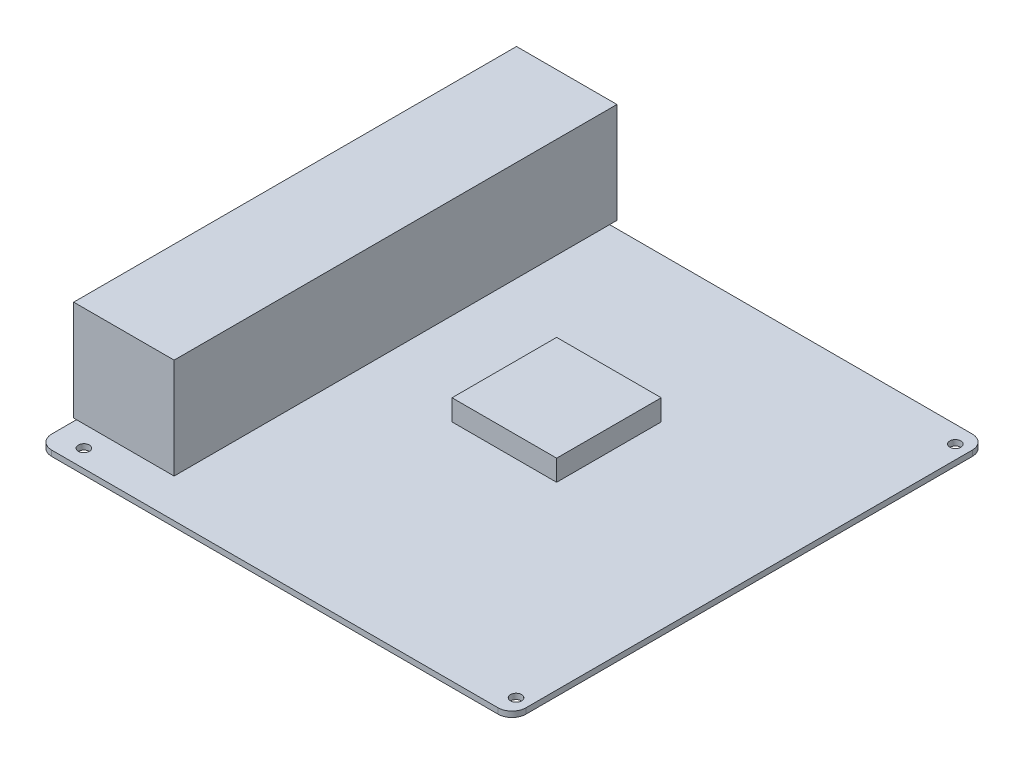
ISO-10303-21;
HEADER;
FILE_DESCRIPTION(('STEP AP214'),'2;1');
FILE_NAME('part.step','',(''),(''),'','','');
FILE_SCHEMA(('AUTOMOTIVE_DESIGN { 1 0 10303 214 1 1 1 1 }'));
ENDSEC;
DATA;
#1=APPLICATION_CONTEXT('core data for automotive mechanical design processes');
#2=APPLICATION_PROTOCOL_DEFINITION('international standard','automotive_design',2000,#1);
#3=PRODUCT_CONTEXT('',#1,'mechanical');
#4=PRODUCT('Part','Part','',(#3));
#5=PRODUCT_RELATED_PRODUCT_CATEGORY('part','',(#4));
#6=PRODUCT_DEFINITION_FORMATION('','',#4);
#7=PRODUCT_DEFINITION_CONTEXT('part definition',#1,'design');
#8=PRODUCT_DEFINITION('design','',#6,#7);
#9=PRODUCT_DEFINITION_SHAPE('','',#8);
#10=(LENGTH_UNIT() NAMED_UNIT(*) SI_UNIT(.MILLI.,.METRE.));
#11=(NAMED_UNIT(*) PLANE_ANGLE_UNIT() SI_UNIT($,.RADIAN.));
#12=(NAMED_UNIT(*) SI_UNIT($,.STERADIAN.) SOLID_ANGLE_UNIT());
#13=UNCERTAINTY_MEASURE_WITH_UNIT(LENGTH_MEASURE(1.E-05),#10,'distance_accuracy_value','');
#14=(GEOMETRIC_REPRESENTATION_CONTEXT(3) GLOBAL_UNCERTAINTY_ASSIGNED_CONTEXT((#13)) GLOBAL_UNIT_ASSIGNED_CONTEXT((#10,
#11,#12)) REPRESENTATION_CONTEXT('',''));
#15=CARTESIAN_POINT('',(0.,0.,0.));
#16=DIRECTION('',(0.,0.,1.));
#17=DIRECTION('',(1.,0.,0.));
#18=AXIS2_PLACEMENT_3D('',#15,#16,#17);
#19=CARTESIAN_POINT('',(20.5,9.5,-33.));
#20=DIRECTION('',(-1.,0.,0.));
#21=DIRECTION('',(0.,0.,1.));
#22=AXIS2_PLACEMENT_3D('',#19,#20,#21);
#23=PLANE('',#22);
#24=DIRECTION('',(0.,0.,-1.));
#25=VECTOR('',#24,1.);
#26=CARTESIAN_POINT('',(20.5,2.,-33.));
#27=LINE('',#26,#25);
#28=CARTESIAN_POINT('',(20.5,2.,4.49999999999998));
#29=VERTEX_POINT('',#28);
#30=CARTESIAN_POINT('',(20.5,2.,-33.));
#31=VERTEX_POINT('',#30);
#32=EDGE_CURVE('E158',#29,#31,#27,.T.);
#33=ORIENTED_EDGE('',*,*,#32,.T.);
#34=DIRECTION('',(0.,-1.,0.));
#35=VECTOR('',#34,1.);
#36=CARTESIAN_POINT('',(20.5,9.5,-33.));
#37=LINE('',#36,#35);
#38=CARTESIAN_POINT('',(20.5,9.5,-33.));
#39=VERTEX_POINT('',#38);
#40=EDGE_CURVE('E14',#39,#31,#37,.T.);
#41=ORIENTED_EDGE('',*,*,#40,.F.);
#42=DIRECTION('',(0.,0.,-1.));
#43=VECTOR('',#42,1.);
#44=CARTESIAN_POINT('',(20.5,9.5,-33.));
#45=LINE('',#44,#43);
#46=CARTESIAN_POINT('',(20.5,9.5,4.49999999999998));
#47=VERTEX_POINT('',#46);
#48=EDGE_CURVE('E146',#47,#39,#45,.T.);
#49=ORIENTED_EDGE('',*,*,#48,.F.);
#50=DIRECTION('',(0.,-1.,0.));
#51=VECTOR('',#50,1.);
#52=CARTESIAN_POINT('',(20.5,9.5,4.49999999999998));
#53=LINE('',#52,#51);
#54=EDGE_CURVE('E154',#47,#29,#53,.T.);
#55=ORIENTED_EDGE('',*,*,#54,.T.);
#56=EDGE_LOOP('',(#33,#41,#49,#55));
#57=FACE_BOUND('',#56,.T.);
#58=ADVANCED_FACE('F95',(#57),#23,.F.);
#59=CARTESIAN_POINT('',(-17.,9.5,-33.));
#60=DIRECTION('',(0.,0.,1.));
#61=DIRECTION('',(1.,0.,0.));
#62=AXIS2_PLACEMENT_3D('',#59,#60,#61);
#63=PLANE('',#62);
#64=DIRECTION('',(-1.,0.,0.));
#65=VECTOR('',#64,1.);
#66=CARTESIAN_POINT('',(-17.,2.,-33.));
#67=LINE('',#66,#65);
#68=CARTESIAN_POINT('',(-17.,2.,-33.));
#69=VERTEX_POINT('',#68);
#70=EDGE_CURVE('E150',#31,#69,#67,.T.);
#71=ORIENTED_EDGE('',*,*,#70,.T.);
#72=DIRECTION('',(0.,-1.,0.));
#73=VECTOR('',#72,1.);
#74=CARTESIAN_POINT('',(-17.,9.5,-33.));
#75=LINE('',#74,#73);
#76=CARTESIAN_POINT('',(-17.,9.5,-33.));
#77=VERTEX_POINT('',#76);
#78=EDGE_CURVE('E103',#77,#69,#75,.T.);
#79=ORIENTED_EDGE('',*,*,#78,.F.);
#80=DIRECTION('',(-1.,0.,0.));
#81=VECTOR('',#80,1.);
#82=CARTESIAN_POINT('',(-17.,9.5,-33.));
#83=LINE('',#82,#81);
#84=EDGE_CURVE('E141',#39,#77,#83,.T.);
#85=ORIENTED_EDGE('',*,*,#84,.F.);
#86=ORIENTED_EDGE('',*,*,#40,.T.);
#87=EDGE_LOOP('',(#71,#79,#85,#86));
#88=FACE_BOUND('',#87,.T.);
#89=ADVANCED_FACE('F149',(#88),#63,.F.);
#90=CARTESIAN_POINT('',(-17.,9.5,-33.));
#91=DIRECTION('',(1.,0.,0.));
#92=DIRECTION('',(0.,0.,-1.));
#93=AXIS2_PLACEMENT_3D('',#90,#91,#92);
#94=PLANE('',#93);
#95=DIRECTION('',(0.,0.,1.));
#96=VECTOR('',#95,1.);
#97=CARTESIAN_POINT('',(-17.,2.,-33.));
#98=LINE('',#97,#96);
#99=CARTESIAN_POINT('',(-17.,2.,4.49999999999998));
#100=VERTEX_POINT('',#99);
#101=EDGE_CURVE('E128',#69,#100,#98,.T.);
#102=ORIENTED_EDGE('',*,*,#101,.T.);
#103=DIRECTION('',(0.,-1.,0.));
#104=VECTOR('',#103,1.);
#105=CARTESIAN_POINT('',(-17.,9.5,4.49999999999998));
#106=LINE('',#105,#104);
#107=CARTESIAN_POINT('',(-17.,9.5,4.49999999999998));
#108=VERTEX_POINT('',#107);
#109=EDGE_CURVE('E151',#108,#100,#106,.T.);
#110=ORIENTED_EDGE('',*,*,#109,.F.);
#111=DIRECTION('',(0.,0.,1.));
#112=VECTOR('',#111,1.);
#113=CARTESIAN_POINT('',(-17.,9.5,-33.));
#114=LINE('',#113,#112);
#115=EDGE_CURVE('E144',#77,#108,#114,.T.);
#116=ORIENTED_EDGE('',*,*,#115,.F.);
#117=ORIENTED_EDGE('',*,*,#78,.T.);
#118=EDGE_LOOP('',(#102,#110,#116,#117));
#119=FACE_BOUND('',#118,.T.);
#120=ADVANCED_FACE('F152',(#119),#94,.F.);
#121=CARTESIAN_POINT('',(-17.,9.5,4.49999999999998));
#122=DIRECTION('',(0.,0.,-1.));
#123=DIRECTION('',(-1.,0.,0.));
#124=AXIS2_PLACEMENT_3D('',#121,#122,#123);
#125=PLANE('',#124);
#126=DIRECTION('',(1.,0.,0.));
#127=VECTOR('',#126,1.);
#128=CARTESIAN_POINT('',(-17.,2.,4.49999999999998));
#129=LINE('',#128,#127);
#130=EDGE_CURVE('E134',#100,#29,#129,.T.);
#131=ORIENTED_EDGE('',*,*,#130,.T.);
#132=ORIENTED_EDGE('',*,*,#54,.F.);
#133=DIRECTION('',(1.,0.,0.));
#134=VECTOR('',#133,1.);
#135=CARTESIAN_POINT('',(-17.,9.5,4.49999999999998));
#136=LINE('',#135,#134);
#137=EDGE_CURVE('E111',#108,#47,#136,.T.);
#138=ORIENTED_EDGE('',*,*,#137,.F.);
#139=ORIENTED_EDGE('',*,*,#109,.T.);
#140=EDGE_LOOP('',(#131,#132,#138,#139));
#141=FACE_BOUND('',#140,.T.);
#142=ADVANCED_FACE('F165',(#141),#125,.F.);
#143=CARTESIAN_POINT('',(0.,9.5,0.));
#144=DIRECTION('',(0.,1.,0.));
#145=DIRECTION('',(0.,0.,1.));
#146=AXIS2_PLACEMENT_3D('',#143,#144,#145);
#147=PLANE('',#146);
#148=ORIENTED_EDGE('',*,*,#48,.T.);
#149=ORIENTED_EDGE('',*,*,#84,.T.);
#150=ORIENTED_EDGE('',*,*,#115,.T.);
#151=ORIENTED_EDGE('',*,*,#137,.T.);
#152=EDGE_LOOP('',(#148,#149,#150,#151));
#153=FACE_BOUND('',#152,.T.);
#154=ADVANCED_FACE('F142',(#153),#147,.T.);
#155=CARTESIAN_POINT('',(0.,2.,0.));
#156=DIRECTION('',(0.,1.,0.));
#157=DIRECTION('',(0.,0.,1.));
#158=AXIS2_PLACEMENT_3D('',#155,#156,#157);
#159=PLANE('',#158);
#160=ORIENTED_EDGE('',*,*,#32,.F.);
#161=ORIENTED_EDGE('',*,*,#130,.F.);
#162=ORIENTED_EDGE('',*,*,#101,.F.);
#163=ORIENTED_EDGE('',*,*,#70,.F.);
#164=EDGE_LOOP('',(#160,#161,#162,#163));
#165=FACE_BOUND('',#164,.T.);
#166=ADVANCED_FACE('F168',(#165),#159,.F.);
#167=CLOSED_SHELL('',(#58,#89,#120,#142,#154,#166));
#168=MANIFOLD_SOLID_BREP('B2',#167);
#169=CARTESIAN_POINT('',(-86.,2.,-87.62));
#170=DIRECTION('',(0.,0.,-1.));
#171=DIRECTION('',(-1.,0.,0.));
#172=AXIS2_PLACEMENT_3D('',#169,#170,#171);
#173=PLANE('',#172);
#174=DIRECTION('',(-1.,0.,0.));
#175=VECTOR('',#174,1.);
#176=CARTESIAN_POINT('',(-68.,38.,-87.62));
#177=LINE('',#176,#175);
#178=CARTESIAN_POINT('',(-50.,38.,-87.62));
#179=VERTEX_POINT('',#178);
#180=CARTESIAN_POINT('',(-86.,38.,-87.62));
#181=VERTEX_POINT('',#180);
#182=EDGE_CURVE('E287',#179,#181,#177,.T.);
#183=ORIENTED_EDGE('',*,*,#182,.F.);
#184=DIRECTION('',(0.,1.,0.));
#185=VECTOR('',#184,1.);
#186=CARTESIAN_POINT('',(-50.,2.,-87.62));
#187=LINE('',#186,#185);
#188=CARTESIAN_POINT('',(-50.,2.,-87.62));
#189=VERTEX_POINT('',#188);
#190=EDGE_CURVE('E322',#189,#179,#187,.T.);
#191=ORIENTED_EDGE('',*,*,#190,.F.);
#192=DIRECTION('',(-1.,0.,0.));
#193=VECTOR('',#192,1.);
#194=CARTESIAN_POINT('',(-68.,2.,-87.62));
#195=LINE('',#194,#193);
#196=CARTESIAN_POINT('',(-86.,2.,-87.62));
#197=VERTEX_POINT('',#196);
#198=EDGE_CURVE('E233',#189,#197,#195,.T.);
#199=ORIENTED_EDGE('',*,*,#198,.T.);
#200=DIRECTION('',(0.,1.,0.));
#201=VECTOR('',#200,1.);
#202=CARTESIAN_POINT('',(-86.,2.,-87.62));
#203=LINE('',#202,#201);
#204=EDGE_CURVE('E320',#197,#181,#203,.T.);
#205=ORIENTED_EDGE('',*,*,#204,.T.);
#206=EDGE_LOOP('',(#183,#191,#199,#205));
#207=FACE_BOUND('',#206,.T.);
#208=ADVANCED_FACE('F229',(#207),#173,.T.);
#209=CARTESIAN_POINT('',(-50.,2.,-87.62));
#210=DIRECTION('',(1.,0.,0.));
#211=DIRECTION('',(0.,0.,-1.));
#212=AXIS2_PLACEMENT_3D('',#209,#210,#211);
#213=PLANE('',#212);
#214=DIRECTION('',(0.,0.,-1.));
#215=VECTOR('',#214,1.);
#216=CARTESIAN_POINT('',(-50.,38.,-8.24500000000004));
#217=LINE('',#216,#215);
#218=CARTESIAN_POINT('',(-50.,38.,71.13));
#219=VERTEX_POINT('',#218);
#220=EDGE_CURVE('E295',#219,#179,#217,.T.);
#221=ORIENTED_EDGE('',*,*,#220,.F.);
#222=DIRECTION('',(0.,1.,0.));
#223=VECTOR('',#222,1.);
#224=CARTESIAN_POINT('',(-50.,2.,71.13));
#225=LINE('',#224,#223);
#226=CARTESIAN_POINT('',(-50.,2.,71.13));
#227=VERTEX_POINT('',#226);
#228=EDGE_CURVE('E273',#227,#219,#225,.T.);
#229=ORIENTED_EDGE('',*,*,#228,.F.);
#230=DIRECTION('',(0.,0.,-1.));
#231=VECTOR('',#230,1.);
#232=CARTESIAN_POINT('',(-50.,2.,-8.24500000000004));
#233=LINE('',#232,#231);
#234=EDGE_CURVE('E300',#227,#189,#233,.T.);
#235=ORIENTED_EDGE('',*,*,#234,.T.);
#236=ORIENTED_EDGE('',*,*,#190,.T.);
#237=EDGE_LOOP('',(#221,#229,#235,#236));
#238=FACE_BOUND('',#237,.T.);
#239=ADVANCED_FACE('F324',(#238),#213,.T.);
#240=CARTESIAN_POINT('',(-86.,2.,71.13));
#241=DIRECTION('',(0.,0.,1.));
#242=DIRECTION('',(1.,0.,0.));
#243=AXIS2_PLACEMENT_3D('',#240,#241,#242);
#244=PLANE('',#243);
#245=DIRECTION('',(1.,0.,0.));
#246=VECTOR('',#245,1.);
#247=CARTESIAN_POINT('',(-68.,38.,71.1299999999999));
#248=LINE('',#247,#246);
#249=CARTESIAN_POINT('',(-86.,38.,71.13));
#250=VERTEX_POINT('',#249);
#251=EDGE_CURVE('E267',#250,#219,#248,.T.);
#252=ORIENTED_EDGE('',*,*,#251,.F.);
#253=DIRECTION('',(0.,1.,0.));
#254=VECTOR('',#253,1.);
#255=CARTESIAN_POINT('',(-86.,2.,71.13));
#256=LINE('',#255,#254);
#257=CARTESIAN_POINT('',(-86.,2.,71.13));
#258=VERTEX_POINT('',#257);
#259=EDGE_CURVE('E271',#258,#250,#256,.T.);
#260=ORIENTED_EDGE('',*,*,#259,.F.);
#261=DIRECTION('',(1.,0.,0.));
#262=VECTOR('',#261,1.);
#263=CARTESIAN_POINT('',(-68.,2.,71.1299999999999));
#264=LINE('',#263,#262);
#265=EDGE_CURVE('E240',#258,#227,#264,.T.);
#266=ORIENTED_EDGE('',*,*,#265,.T.);
#267=ORIENTED_EDGE('',*,*,#228,.T.);
#268=EDGE_LOOP('',(#252,#260,#266,#267));
#269=FACE_BOUND('',#268,.T.);
#270=ADVANCED_FACE('F269',(#269),#244,.T.);
#271=CARTESIAN_POINT('',(-86.,2.,-87.62));
#272=DIRECTION('',(-1.,0.,0.));
#273=DIRECTION('',(0.,0.,1.));
#274=AXIS2_PLACEMENT_3D('',#271,#272,#273);
#275=PLANE('',#274);
#276=DIRECTION('',(0.,0.,1.));
#277=VECTOR('',#276,1.);
#278=CARTESIAN_POINT('',(-86.,38.,-8.24500000000004));
#279=LINE('',#278,#277);
#280=EDGE_CURVE('E278',#181,#250,#279,.T.);
#281=ORIENTED_EDGE('',*,*,#280,.F.);
#282=ORIENTED_EDGE('',*,*,#204,.F.);
#283=DIRECTION('',(0.,0.,1.));
#284=VECTOR('',#283,1.);
#285=CARTESIAN_POINT('',(-86.,2.,-8.24500000000004));
#286=LINE('',#285,#284);
#287=EDGE_CURVE('E93',#197,#258,#286,.T.);
#288=ORIENTED_EDGE('',*,*,#287,.T.);
#289=ORIENTED_EDGE('',*,*,#259,.T.);
#290=EDGE_LOOP('',(#281,#282,#288,#289));
#291=FACE_BOUND('',#290,.T.);
#292=ADVANCED_FACE('F281',(#291),#275,.T.);
#293=CARTESIAN_POINT('',(-50.,38.,71.1299999999999));
#294=DIRECTION('',(0.,1.,0.));
#295=DIRECTION('',(0.,0.,-1.));
#296=AXIS2_PLACEMENT_3D('',#293,#294,#295);
#297=PLANE('',#296);
#298=ORIENTED_EDGE('',*,*,#220,.T.);
#299=ORIENTED_EDGE('',*,*,#182,.T.);
#300=ORIENTED_EDGE('',*,*,#280,.T.);
#301=ORIENTED_EDGE('',*,*,#251,.T.);
#302=EDGE_LOOP('',(#298,#299,#300,#301));
#303=FACE_BOUND('',#302,.T.);
#304=ADVANCED_FACE('F286',(#303),#297,.T.);
#305=CARTESIAN_POINT('',(-86.,2.,-87.62));
#306=DIRECTION('',(0.,1.,0.));
#307=DIRECTION('',(0.,0.,1.));
#308=AXIS2_PLACEMENT_3D('',#305,#306,#307);
#309=PLANE('',#308);
#310=ORIENTED_EDGE('',*,*,#287,.F.);
#311=ORIENTED_EDGE('',*,*,#198,.F.);
#312=ORIENTED_EDGE('',*,*,#234,.F.);
#313=ORIENTED_EDGE('',*,*,#265,.F.);
#314=EDGE_LOOP('',(#310,#311,#312,#313));
#315=FACE_BOUND('',#314,.T.);
#316=ADVANCED_FACE('F231',(#315),#309,.F.);
#317=OPEN_SHELL('',(#208,#239,#270,#292,#304,#316));
#318=SHELL_BASED_SURFACE_MODEL('B8',(#317));
#319=CARTESIAN_POINT('',(85.,2.,85.));
#320=DIRECTION('',(-1.,0.,0.));
#321=DIRECTION('',(0.,0.,1.));
#322=AXIS2_PLACEMENT_3D('',#319,#320,#321);
#323=PLANE('',#322);
#324=DIRECTION('',(0.,0.,-1.));
#325=VECTOR('',#324,1.);
#326=CARTESIAN_POINT('',(85.,2.,85.));
#327=LINE('',#326,#325);
#328=CARTESIAN_POINT('',(85.,2.,80.));
#329=VERTEX_POINT('',#328);
#330=CARTESIAN_POINT('',(85.,2.,-80.));
#331=VERTEX_POINT('',#330);
#332=EDGE_CURVE('E498',#329,#331,#327,.T.);
#333=ORIENTED_EDGE('',*,*,#332,.F.);
#334=DIRECTION('',(0.,-1.,0.));
#335=VECTOR('',#334,1.);
#336=CARTESIAN_POINT('',(85.,2.,80.));
#337=LINE('',#336,#335);
#338=CARTESIAN_POINT('',(85.,0.,80.));
#339=VERTEX_POINT('',#338);
#340=EDGE_CURVE('E524',#329,#339,#337,.T.);
#341=ORIENTED_EDGE('',*,*,#340,.T.);
#342=DIRECTION('',(0.,0.,-1.));
#343=VECTOR('',#342,1.);
#344=CARTESIAN_POINT('',(85.,0.,85.));
#345=LINE('',#344,#343);
#346=CARTESIAN_POINT('',(85.,0.,-80.));
#347=VERTEX_POINT('',#346);
#348=EDGE_CURVE('E530',#339,#347,#345,.T.);
#349=ORIENTED_EDGE('',*,*,#348,.T.);
#350=DIRECTION('',(0.,-1.,0.));
#351=VECTOR('',#350,1.);
#352=CARTESIAN_POINT('',(85.,2.,-80.));
#353=LINE('',#352,#351);
#354=EDGE_CURVE('E522',#347,#331,#353,.F.);
#355=ORIENTED_EDGE('',*,*,#354,.T.);
#356=EDGE_LOOP('',(#333,#341,#349,#355));
#357=FACE_BOUND('',#356,.T.);
#358=ADVANCED_FACE('F406',(#357),#323,.F.);
#359=CARTESIAN_POINT('',(-85.,2.,-85.));
#360=DIRECTION('',(0.,0.,1.));
#361=DIRECTION('',(1.,0.,0.));
#362=AXIS2_PLACEMENT_3D('',#359,#360,#361);
#363=PLANE('',#362);
#364=DIRECTION('',(-1.,0.,0.));
#365=VECTOR('',#364,1.);
#366=CARTESIAN_POINT('',(-85.,2.,-85.));
#367=LINE('',#366,#365);
#368=CARTESIAN_POINT('',(80.,2.,-85.));
#369=VERTEX_POINT('',#368);
#370=CARTESIAN_POINT('',(-80.,2.,-85.));
#371=VERTEX_POINT('',#370);
#372=EDGE_CURVE('E501',#369,#371,#367,.T.);
#373=ORIENTED_EDGE('',*,*,#372,.F.);
#374=DIRECTION('',(0.,-1.,0.));
#375=VECTOR('',#374,1.);
#376=CARTESIAN_POINT('',(80.,2.,-85.));
#377=LINE('',#376,#375);
#378=CARTESIAN_POINT('',(80.,0.,-85.));
#379=VERTEX_POINT('',#378);
#380=EDGE_CURVE('E227',#369,#379,#377,.T.);
#381=ORIENTED_EDGE('',*,*,#380,.T.);
#382=DIRECTION('',(-1.,0.,0.));
#383=VECTOR('',#382,1.);
#384=CARTESIAN_POINT('',(-85.,0.,-85.));
#385=LINE('',#384,#383);
#386=CARTESIAN_POINT('',(-80.,0.,-85.));
#387=VERTEX_POINT('',#386);
#388=EDGE_CURVE('E503',#379,#387,#385,.T.);
#389=ORIENTED_EDGE('',*,*,#388,.T.);
#390=DIRECTION('',(0.,-1.,0.));
#391=VECTOR('',#390,1.);
#392=CARTESIAN_POINT('',(-80.,2.,-85.));
#393=LINE('',#392,#391);
#394=EDGE_CURVE('E414',#387,#371,#393,.F.);
#395=ORIENTED_EDGE('',*,*,#394,.T.);
#396=EDGE_LOOP('',(#373,#381,#389,#395));
#397=FACE_BOUND('',#396,.T.);
#398=ADVANCED_FACE('F584',(#397),#363,.F.);
#399=CARTESIAN_POINT('',(-85.,2.,85.));
#400=DIRECTION('',(1.,0.,0.));
#401=DIRECTION('',(0.,0.,-1.));
#402=AXIS2_PLACEMENT_3D('',#399,#400,#401);
#403=PLANE('',#402);
#404=DIRECTION('',(0.,0.,1.));
#405=VECTOR('',#404,1.);
#406=CARTESIAN_POINT('',(-85.,0.,85.));
#407=LINE('',#406,#405);
#408=CARTESIAN_POINT('',(-85.,0.,-80.));
#409=VERTEX_POINT('',#408);
#410=CARTESIAN_POINT('',(-85.,0.,80.));
#411=VERTEX_POINT('',#410);
#412=EDGE_CURVE('E499',#409,#411,#407,.T.);
#413=ORIENTED_EDGE('',*,*,#412,.T.);
#414=DIRECTION('',(0.,-1.,0.));
#415=VECTOR('',#414,1.);
#416=CARTESIAN_POINT('',(-85.,2.,80.));
#417=LINE('',#416,#415);
#418=CARTESIAN_POINT('',(-85.,2.,80.));
#419=VERTEX_POINT('',#418);
#420=EDGE_CURVE('E477',#411,#419,#417,.F.);
#421=ORIENTED_EDGE('',*,*,#420,.T.);
#422=DIRECTION('',(0.,0.,1.));
#423=VECTOR('',#422,1.);
#424=CARTESIAN_POINT('',(-85.,2.,85.));
#425=LINE('',#424,#423);
#426=CARTESIAN_POINT('',(-85.,2.,-80.));
#427=VERTEX_POINT('',#426);
#428=EDGE_CURVE('E542',#427,#419,#425,.T.);
#429=ORIENTED_EDGE('',*,*,#428,.F.);
#430=DIRECTION('',(0.,-1.,0.));
#431=VECTOR('',#430,1.);
#432=CARTESIAN_POINT('',(-85.,2.,-80.));
#433=LINE('',#432,#431);
#434=EDGE_CURVE('E482',#427,#409,#433,.T.);
#435=ORIENTED_EDGE('',*,*,#434,.T.);
#436=EDGE_LOOP('',(#413,#421,#429,#435));
#437=FACE_BOUND('',#436,.T.);
#438=ADVANCED_FACE('F582',(#437),#403,.F.);
#439=CARTESIAN_POINT('',(-85.,2.,85.));
#440=DIRECTION('',(0.,0.,-1.));
#441=DIRECTION('',(-1.,0.,0.));
#442=AXIS2_PLACEMENT_3D('',#439,#440,#441);
#443=PLANE('',#442);
#444=DIRECTION('',(1.,0.,0.));
#445=VECTOR('',#444,1.);
#446=CARTESIAN_POINT('',(-85.,2.,85.));
#447=LINE('',#446,#445);
#448=CARTESIAN_POINT('',(-80.,2.,85.));
#449=VERTEX_POINT('',#448);
#450=CARTESIAN_POINT('',(80.,2.,85.));
#451=VERTEX_POINT('',#450);
#452=EDGE_CURVE('E492',#449,#451,#447,.T.);
#453=ORIENTED_EDGE('',*,*,#452,.F.);
#454=DIRECTION('',(0.,-1.,0.));
#455=VECTOR('',#454,1.);
#456=CARTESIAN_POINT('',(-80.,2.,85.));
#457=LINE('',#456,#455);
#458=CARTESIAN_POINT('',(-80.,0.,85.));
#459=VERTEX_POINT('',#458);
#460=EDGE_CURVE('E476',#449,#459,#457,.T.);
#461=ORIENTED_EDGE('',*,*,#460,.T.);
#462=DIRECTION('',(1.,0.,0.));
#463=VECTOR('',#462,1.);
#464=CARTESIAN_POINT('',(-85.,0.,85.));
#465=LINE('',#464,#463);
#466=CARTESIAN_POINT('',(80.,0.,85.));
#467=VERTEX_POINT('',#466);
#468=EDGE_CURVE('E489',#459,#467,#465,.T.);
#469=ORIENTED_EDGE('',*,*,#468,.T.);
#470=DIRECTION('',(0.,-1.,0.));
#471=VECTOR('',#470,1.);
#472=CARTESIAN_POINT('',(80.,2.,85.));
#473=LINE('',#472,#471);
#474=EDGE_CURVE('E494',#467,#451,#473,.F.);
#475=ORIENTED_EDGE('',*,*,#474,.T.);
#476=EDGE_LOOP('',(#453,#461,#469,#475));
#477=FACE_BOUND('',#476,.T.);
#478=ADVANCED_FACE('F488',(#477),#443,.F.);
#479=CARTESIAN_POINT('',(0.,2.,0.));
#480=DIRECTION('',(0.,-1.,0.));
#481=DIRECTION('',(0.,0.,-1.));
#482=AXIS2_PLACEMENT_3D('',#479,#480,#481);
#483=PLANE('',#482);
#484=CARTESIAN_POINT('',(-74.84,2.,78.65));
#485=DIRECTION('',(0.,1.,0.));
#486=DIRECTION('',(0.,0.,1.));
#487=AXIS2_PLACEMENT_3D('',#484,#485,#486);
#488=CIRCLE('',#487,1.98);
#489=CARTESIAN_POINT('',(-74.84,2.,80.63));
#490=VERTEX_POINT('',#489);
#491=EDGE_CURVE('E538',#490,#490,#488,.T.);
#492=ORIENTED_EDGE('',*,*,#491,.F.);
#493=EDGE_LOOP('',(#492));
#494=FACE_BOUND('',#493,.T.);
#495=CARTESIAN_POINT('',(-51.98,2.,-78.83));
#496=DIRECTION('',(0.,1.,0.));
#497=DIRECTION('',(0.,0.,1.));
#498=AXIS2_PLACEMENT_3D('',#495,#496,#497);
#499=CIRCLE('',#498,1.98);
#500=CARTESIAN_POINT('',(-51.98,2.,-76.85));
#501=VERTEX_POINT('',#500);
#502=EDGE_CURVE('E558',#501,#501,#499,.T.);
#503=ORIENTED_EDGE('',*,*,#502,.F.);
#504=EDGE_LOOP('',(#503));
#505=FACE_BOUND('',#504,.T.);
#506=CARTESIAN_POINT('',(80.1,2.,-78.83));
#507=DIRECTION('',(0.,1.,0.));
#508=DIRECTION('',(0.,0.,1.));
#509=AXIS2_PLACEMENT_3D('',#506,#507,#508);
#510=CIRCLE('',#509,1.98);
#511=CARTESIAN_POINT('',(80.1,2.,-76.85));
#512=VERTEX_POINT('',#511);
#513=EDGE_CURVE('E552',#512,#512,#510,.T.);
#514=ORIENTED_EDGE('',*,*,#513,.F.);
#515=EDGE_LOOP('',(#514));
#516=FACE_BOUND('',#515,.T.);
#517=CARTESIAN_POINT('',(80.1,2.,78.65));
#518=DIRECTION('',(0.,1.,0.));
#519=DIRECTION('',(0.,0.,1.));
#520=AXIS2_PLACEMENT_3D('',#517,#518,#519);
#521=CIRCLE('',#520,1.98);
#522=CARTESIAN_POINT('',(80.1,2.,80.63));
#523=VERTEX_POINT('',#522);
#524=EDGE_CURVE('E546',#523,#523,#521,.T.);
#525=ORIENTED_EDGE('',*,*,#524,.F.);
#526=EDGE_LOOP('',(#525));
#527=FACE_BOUND('',#526,.T.);
#528=ORIENTED_EDGE('',*,*,#428,.T.);
#529=CARTESIAN_POINT('',(-80.,2.,80.));
#530=DIRECTION('',(0.,-1.,0.));
#531=DIRECTION('',(0.,0.,-1.));
#532=AXIS2_PLACEMENT_3D('',#529,#530,#531);
#533=CIRCLE('',#532,5.);
#534=EDGE_CURVE('E520',#419,#449,#533,.F.);
#535=ORIENTED_EDGE('',*,*,#534,.T.);
#536=ORIENTED_EDGE('',*,*,#452,.T.);
#537=CARTESIAN_POINT('',(80.,2.,80.));
#538=DIRECTION('',(0.,-1.,0.));
#539=DIRECTION('',(0.,0.,-1.));
#540=AXIS2_PLACEMENT_3D('',#537,#538,#539);
#541=CIRCLE('',#540,5.);
#542=EDGE_CURVE('E518',#451,#329,#541,.F.);
#543=ORIENTED_EDGE('',*,*,#542,.T.);
#544=ORIENTED_EDGE('',*,*,#332,.T.);
#545=CARTESIAN_POINT('',(80.,2.,-80.));
#546=DIRECTION('',(0.,-1.,0.));
#547=DIRECTION('',(0.,0.,-1.));
#548=AXIS2_PLACEMENT_3D('',#545,#546,#547);
#549=CIRCLE('',#548,5.);
#550=EDGE_CURVE('E427',#331,#369,#549,.F.);
#551=ORIENTED_EDGE('',*,*,#550,.T.);
#552=ORIENTED_EDGE('',*,*,#372,.T.);
#553=CARTESIAN_POINT('',(-80.,2.,-80.));
#554=DIRECTION('',(0.,-1.,0.));
#555=DIRECTION('',(0.,0.,-1.));
#556=AXIS2_PLACEMENT_3D('',#553,#554,#555);
#557=CIRCLE('',#556,5.);
#558=EDGE_CURVE('E515',#371,#427,#557,.F.);
#559=ORIENTED_EDGE('',*,*,#558,.T.);
#560=EDGE_LOOP('',(#528,#535,#536,#543,#544,#551,#552,#559));
#561=FACE_BOUND('',#560,.T.);
#562=ADVANCED_FACE('F569',(#494,#505,#516,#527,#561),#483,.F.);
#563=CARTESIAN_POINT('',(0.,0.,0.));
#564=DIRECTION('',(0.,-1.,0.));
#565=DIRECTION('',(0.,0.,-1.));
#566=AXIS2_PLACEMENT_3D('',#563,#564,#565);
#567=PLANE('',#566);
#568=CARTESIAN_POINT('',(-74.84,0.,78.65));
#569=DIRECTION('',(0.,1.,0.));
#570=DIRECTION('',(0.,0.,1.));
#571=AXIS2_PLACEMENT_3D('',#568,#569,#570);
#572=CIRCLE('',#571,1.98);
#573=CARTESIAN_POINT('',(-74.84,0.,80.63));
#574=VERTEX_POINT('',#573);
#575=EDGE_CURVE('E535',#574,#574,#572,.T.);
#576=ORIENTED_EDGE('',*,*,#575,.T.);
#577=EDGE_LOOP('',(#576));
#578=FACE_BOUND('',#577,.T.);
#579=CARTESIAN_POINT('',(-51.98,0.,-78.83));
#580=DIRECTION('',(0.,1.,0.));
#581=DIRECTION('',(0.,0.,1.));
#582=AXIS2_PLACEMENT_3D('',#579,#580,#581);
#583=CIRCLE('',#582,1.98);
#584=CARTESIAN_POINT('',(-51.98,0.,-76.85));
#585=VERTEX_POINT('',#584);
#586=EDGE_CURVE('E561',#585,#585,#583,.T.);
#587=ORIENTED_EDGE('',*,*,#586,.T.);
#588=EDGE_LOOP('',(#587));
#589=FACE_BOUND('',#588,.T.);
#590=CARTESIAN_POINT('',(80.1,0.,-78.83));
#591=DIRECTION('',(0.,1.,0.));
#592=DIRECTION('',(0.,0.,1.));
#593=AXIS2_PLACEMENT_3D('',#590,#591,#592);
#594=CIRCLE('',#593,1.98);
#595=CARTESIAN_POINT('',(80.1,0.,-76.85));
#596=VERTEX_POINT('',#595);
#597=EDGE_CURVE('E555',#596,#596,#594,.T.);
#598=ORIENTED_EDGE('',*,*,#597,.T.);
#599=EDGE_LOOP('',(#598));
#600=FACE_BOUND('',#599,.T.);
#601=CARTESIAN_POINT('',(80.1,0.,78.65));
#602=DIRECTION('',(0.,1.,0.));
#603=DIRECTION('',(0.,0.,1.));
#604=AXIS2_PLACEMENT_3D('',#601,#602,#603);
#605=CIRCLE('',#604,1.98);
#606=CARTESIAN_POINT('',(80.1,0.,80.63));
#607=VERTEX_POINT('',#606);
#608=EDGE_CURVE('E549',#607,#607,#605,.T.);
#609=ORIENTED_EDGE('',*,*,#608,.T.);
#610=EDGE_LOOP('',(#609));
#611=FACE_BOUND('',#610,.T.);
#612=ORIENTED_EDGE('',*,*,#468,.F.);
#613=CARTESIAN_POINT('',(-80.,0.,80.));
#614=DIRECTION('',(0.,-1.,0.));
#615=DIRECTION('',(0.,0.,-1.));
#616=AXIS2_PLACEMENT_3D('',#613,#614,#615);
#617=CIRCLE('',#616,5.);
#618=EDGE_CURVE('E472',#459,#411,#617,.T.);
#619=ORIENTED_EDGE('',*,*,#618,.T.);
#620=ORIENTED_EDGE('',*,*,#412,.F.);
#621=CARTESIAN_POINT('',(-80.,0.,-80.));
#622=DIRECTION('',(0.,-1.,0.));
#623=DIRECTION('',(0.,0.,-1.));
#624=AXIS2_PLACEMENT_3D('',#621,#622,#623);
#625=CIRCLE('',#624,5.);
#626=EDGE_CURVE('E493',#409,#387,#625,.T.);
#627=ORIENTED_EDGE('',*,*,#626,.T.);
#628=ORIENTED_EDGE('',*,*,#388,.F.);
#629=CARTESIAN_POINT('',(80.,0.,-80.));
#630=DIRECTION('',(0.,-1.,0.));
#631=DIRECTION('',(0.,0.,-1.));
#632=AXIS2_PLACEMENT_3D('',#629,#630,#631);
#633=CIRCLE('',#632,5.);
#634=EDGE_CURVE('E509',#379,#347,#633,.T.);
#635=ORIENTED_EDGE('',*,*,#634,.T.);
#636=ORIENTED_EDGE('',*,*,#348,.F.);
#637=CARTESIAN_POINT('',(80.,0.,80.));
#638=DIRECTION('',(0.,-1.,0.));
#639=DIRECTION('',(0.,0.,-1.));
#640=AXIS2_PLACEMENT_3D('',#637,#638,#639);
#641=CIRCLE('',#640,5.);
#642=EDGE_CURVE('E483',#339,#467,#641,.T.);
#643=ORIENTED_EDGE('',*,*,#642,.T.);
#644=EDGE_LOOP('',(#612,#619,#620,#627,#628,#635,#636,#643));
#645=FACE_BOUND('',#644,.T.);
#646=ADVANCED_FACE('F496',(#578,#589,#600,#611,#645),#567,.T.);
#647=CARTESIAN_POINT('',(80.1,0.,78.65));
#648=DIRECTION('',(0.,1.,0.));
#649=DIRECTION('',(0.,0.,1.));
#650=AXIS2_PLACEMENT_3D('',#647,#648,#649);
#651=CYLINDRICAL_SURFACE('',#650,1.98);
#652=ORIENTED_EDGE('',*,*,#608,.F.);
#653=EDGE_LOOP('',(#652));
#654=FACE_BOUND('',#653,.T.);
#655=ORIENTED_EDGE('',*,*,#524,.T.);
#656=EDGE_LOOP('',(#655));
#657=FACE_BOUND('',#656,.T.);
#658=ADVANCED_FACE('F608',(#654,#657),#651,.F.);
#659=CARTESIAN_POINT('',(80.1,0.,-78.83));
#660=DIRECTION('',(0.,1.,0.));
#661=DIRECTION('',(0.,0.,1.));
#662=AXIS2_PLACEMENT_3D('',#659,#660,#661);
#663=CYLINDRICAL_SURFACE('',#662,1.98);
#664=ORIENTED_EDGE('',*,*,#597,.F.);
#665=EDGE_LOOP('',(#664));
#666=FACE_BOUND('',#665,.T.);
#667=ORIENTED_EDGE('',*,*,#513,.T.);
#668=EDGE_LOOP('',(#667));
#669=FACE_BOUND('',#668,.T.);
#670=ADVANCED_FACE('F613',(#666,#669),#663,.F.);
#671=CARTESIAN_POINT('',(-51.98,0.,-78.83));
#672=DIRECTION('',(0.,1.,0.));
#673=DIRECTION('',(0.,0.,1.));
#674=AXIS2_PLACEMENT_3D('',#671,#672,#673);
#675=CYLINDRICAL_SURFACE('',#674,1.98);
#676=ORIENTED_EDGE('',*,*,#586,.F.);
#677=EDGE_LOOP('',(#676));
#678=FACE_BOUND('',#677,.T.);
#679=ORIENTED_EDGE('',*,*,#502,.T.);
#680=EDGE_LOOP('',(#679));
#681=FACE_BOUND('',#680,.T.);
#682=ADVANCED_FACE('F617',(#678,#681),#675,.F.);
#683=CARTESIAN_POINT('',(-74.84,0.,78.65));
#684=DIRECTION('',(0.,1.,0.));
#685=DIRECTION('',(0.,0.,1.));
#686=AXIS2_PLACEMENT_3D('',#683,#684,#685);
#687=CYLINDRICAL_SURFACE('',#686,1.98);
#688=ORIENTED_EDGE('',*,*,#575,.F.);
#689=EDGE_LOOP('',(#688));
#690=FACE_BOUND('',#689,.T.);
#691=ORIENTED_EDGE('',*,*,#491,.T.);
#692=EDGE_LOOP('',(#691));
#693=FACE_BOUND('',#692,.T.);
#694=ADVANCED_FACE('F567',(#690,#693),#687,.F.);
#695=CARTESIAN_POINT('',(-80.,2.,80.));
#696=DIRECTION('',(0.,-1.,0.));
#697=DIRECTION('',(0.,0.,-1.));
#698=AXIS2_PLACEMENT_3D('',#695,#696,#697);
#699=CYLINDRICAL_SURFACE('',#698,5.);
#700=ORIENTED_EDGE('',*,*,#534,.F.);
#701=ORIENTED_EDGE('',*,*,#420,.F.);
#702=ORIENTED_EDGE('',*,*,#618,.F.);
#703=ORIENTED_EDGE('',*,*,#460,.F.);
#704=EDGE_LOOP('',(#700,#701,#702,#703));
#705=FACE_BOUND('',#704,.T.);
#706=ADVANCED_FACE('F475',(#705),#699,.T.);
#707=CARTESIAN_POINT('',(80.,2.,80.));
#708=DIRECTION('',(0.,-1.,0.));
#709=DIRECTION('',(0.,0.,-1.));
#710=AXIS2_PLACEMENT_3D('',#707,#708,#709);
#711=CYLINDRICAL_SURFACE('',#710,5.);
#712=ORIENTED_EDGE('',*,*,#542,.F.);
#713=ORIENTED_EDGE('',*,*,#474,.F.);
#714=ORIENTED_EDGE('',*,*,#642,.F.);
#715=ORIENTED_EDGE('',*,*,#340,.F.);
#716=EDGE_LOOP('',(#712,#713,#714,#715));
#717=FACE_BOUND('',#716,.T.);
#718=ADVANCED_FACE('F588',(#717),#711,.T.);
#719=CARTESIAN_POINT('',(80.,2.,-80.));
#720=DIRECTION('',(0.,-1.,0.));
#721=DIRECTION('',(0.,0.,-1.));
#722=AXIS2_PLACEMENT_3D('',#719,#720,#721);
#723=CYLINDRICAL_SURFACE('',#722,5.);
#724=ORIENTED_EDGE('',*,*,#550,.F.);
#725=ORIENTED_EDGE('',*,*,#354,.F.);
#726=ORIENTED_EDGE('',*,*,#634,.F.);
#727=ORIENTED_EDGE('',*,*,#380,.F.);
#728=EDGE_LOOP('',(#724,#725,#726,#727));
#729=FACE_BOUND('',#728,.T.);
#730=ADVANCED_FACE('F587',(#729),#723,.T.);
#731=CARTESIAN_POINT('',(-80.,2.,-80.));
#732=DIRECTION('',(0.,-1.,0.));
#733=DIRECTION('',(0.,0.,-1.));
#734=AXIS2_PLACEMENT_3D('',#731,#732,#733);
#735=CYLINDRICAL_SURFACE('',#734,5.);
#736=ORIENTED_EDGE('',*,*,#558,.F.);
#737=ORIENTED_EDGE('',*,*,#394,.F.);
#738=ORIENTED_EDGE('',*,*,#626,.F.);
#739=ORIENTED_EDGE('',*,*,#434,.F.);
#740=EDGE_LOOP('',(#736,#737,#738,#739));
#741=FACE_BOUND('',#740,.T.);
#742=ADVANCED_FACE('F408',(#741),#735,.T.);
#743=CLOSED_SHELL('',(#358,#398,#438,#478,#562,#646,#658,#670,#682,#694,#706,#718,#730,#742));
#744=MANIFOLD_SOLID_BREP('B87',#743);
#745=ADVANCED_BREP_SHAPE_REPRESENTATION('',(#18,#168,#744),#14);
#746=MANIFOLD_SURFACE_SHAPE_REPRESENTATION('',(#18,#318),#14);
#747=SHAPE_REPRESENTATION('',(#18),#14);
#748=SHAPE_DEFINITION_REPRESENTATION(#9,#747);
#749=SHAPE_REPRESENTATION_RELATIONSHIP('','',#747,#745);
#750=SHAPE_REPRESENTATION_RELATIONSHIP('','',#747,#746);
ENDSEC;
END-ISO-10303-21;
